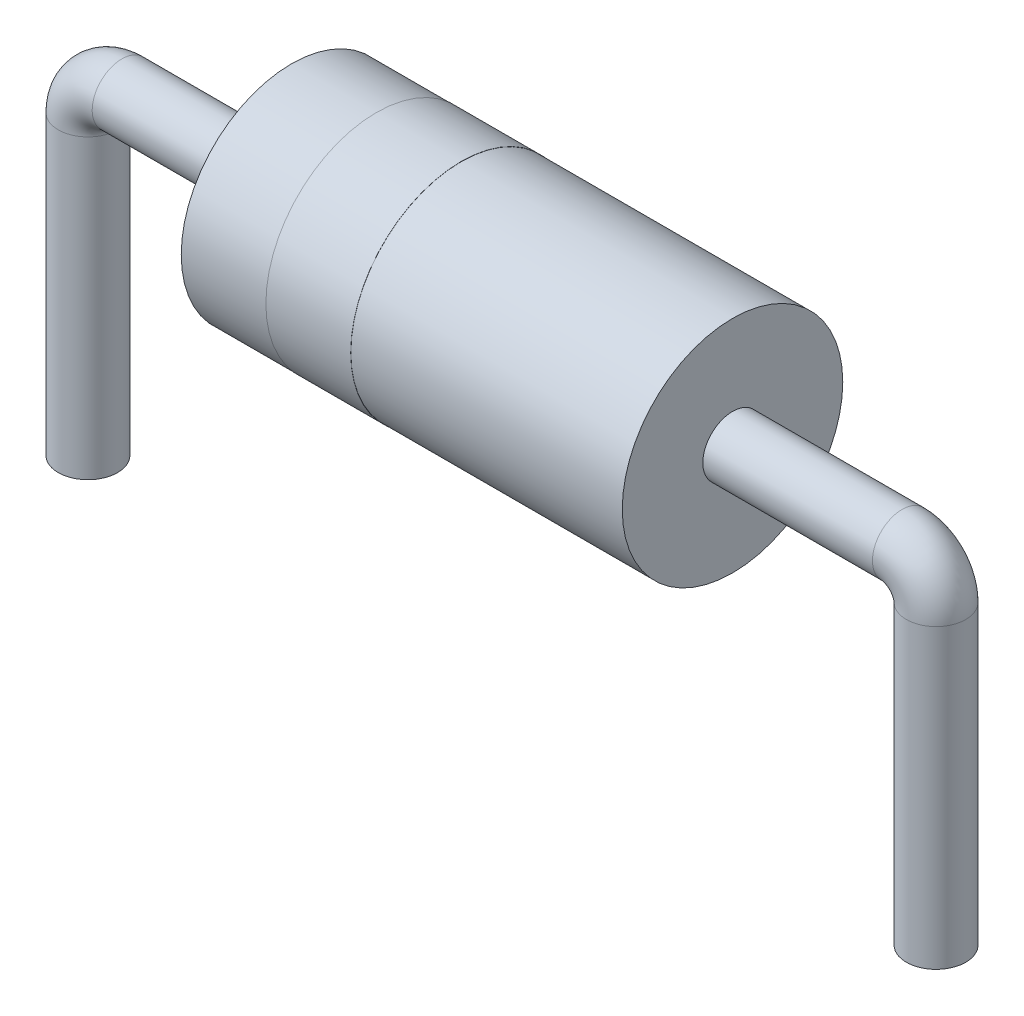
ISO-10303-21;
HEADER;
FILE_DESCRIPTION(('STEP AP214'),'2;1');
FILE_NAME('part.step','',(''),(''),'','','');
FILE_SCHEMA(('AUTOMOTIVE_DESIGN { 1 0 10303 214 1 1 1 1 }'));
ENDSEC;
DATA;
#1=APPLICATION_CONTEXT('core data for automotive mechanical design processes');
#2=APPLICATION_PROTOCOL_DEFINITION('international standard','automotive_design',2000,#1);
#3=PRODUCT_CONTEXT('',#1,'mechanical');
#4=PRODUCT('Part','Part','',(#3));
#5=PRODUCT_RELATED_PRODUCT_CATEGORY('part','',(#4));
#6=PRODUCT_DEFINITION_FORMATION('','',#4);
#7=PRODUCT_DEFINITION_CONTEXT('part definition',#1,'design');
#8=PRODUCT_DEFINITION('design','',#6,#7);
#9=PRODUCT_DEFINITION_SHAPE('','',#8);
#10=(LENGTH_UNIT() NAMED_UNIT(*) SI_UNIT(.MILLI.,.METRE.));
#11=(NAMED_UNIT(*) PLANE_ANGLE_UNIT() SI_UNIT($,.RADIAN.));
#12=(NAMED_UNIT(*) SI_UNIT($,.STERADIAN.) SOLID_ANGLE_UNIT());
#13=UNCERTAINTY_MEASURE_WITH_UNIT(LENGTH_MEASURE(1.E-05),#10,'distance_accuracy_value','');
#14=(GEOMETRIC_REPRESENTATION_CONTEXT(3) GLOBAL_UNCERTAINTY_ASSIGNED_CONTEXT((#13)) GLOBAL_UNIT_ASSIGNED_CONTEXT((#10,
#11,#12)) REPRESENTATION_CONTEXT('',''));
#15=CARTESIAN_POINT('',(0.,0.,0.));
#16=DIRECTION('',(0.,0.,1.));
#17=DIRECTION('',(1.,0.,0.));
#18=AXIS2_PLACEMENT_3D('',#15,#16,#17);
#19=CARTESIAN_POINT('',(0.,0.,0.));
#20=DIRECTION('',(1.,0.,0.));
#21=DIRECTION('',(0.,0.,-1.));
#22=AXIS2_PLACEMENT_3D('',#19,#20,#21);
#23=PLANE('',#22);
#24=CARTESIAN_POINT('',(0.,0.,0.));
#25=DIRECTION('',(1.,0.,0.));
#26=DIRECTION('',(0.,0.,-1.));
#27=AXIS2_PLACEMENT_3D('',#24,#25,#26);
#28=CIRCLE('',#27,1.3);
#29=CARTESIAN_POINT('',(0.,0.,-1.3));
#30=VERTEX_POINT('',#29);
#31=EDGE_CURVE('E74',#30,#30,#28,.T.);
#32=ORIENTED_EDGE('',*,*,#31,.F.);
#33=EDGE_LOOP('',(#32));
#34=FACE_BOUND('',#33,.T.);
#35=CARTESIAN_POINT('',(0.,0.,0.));
#36=DIRECTION('',(-1.,0.,0.));
#37=DIRECTION('',(0.,0.,1.));
#38=AXIS2_PLACEMENT_3D('',#35,#36,#37);
#39=CIRCLE('',#38,0.35);
#40=CARTESIAN_POINT('',(0.,0.,0.35));
#41=VERTEX_POINT('',#40);
#42=EDGE_CURVE('E10',#41,#41,#39,.T.);
#43=ORIENTED_EDGE('',*,*,#42,.F.);
#44=EDGE_LOOP('',(#43));
#45=FACE_BOUND('',#44,.T.);
#46=ADVANCED_FACE('F32',(#34,#45),#23,.F.);
#47=CARTESIAN_POINT('',(5.2,0.,0.));
#48=DIRECTION('',(-1.,0.,0.));
#49=DIRECTION('',(0.,0.,1.));
#50=AXIS2_PLACEMENT_3D('',#47,#48,#49);
#51=CYLINDRICAL_SURFACE('',#50,1.3);
#52=CARTESIAN_POINT('',(1.,0.,0.));
#53=DIRECTION('',(-1.,0.,0.));
#54=DIRECTION('',(0.,0.,1.));
#55=AXIS2_PLACEMENT_3D('',#52,#53,#54);
#56=CIRCLE('',#55,1.3);
#57=CARTESIAN_POINT('',(1.,0.,1.3));
#58=VERTEX_POINT('',#57);
#59=EDGE_CURVE('E36',#58,#58,#56,.T.);
#60=ORIENTED_EDGE('',*,*,#59,.T.);
#61=EDGE_LOOP('',(#60));
#62=FACE_BOUND('',#61,.T.);
#63=ORIENTED_EDGE('',*,*,#31,.T.);
#64=EDGE_LOOP('',(#63));
#65=FACE_BOUND('',#64,.T.);
#66=ADVANCED_FACE('F34',(#62,#65),#51,.T.);
#67=CARTESIAN_POINT('',(1.,0.,0.));
#68=DIRECTION('',(-1.,0.,0.));
#69=DIRECTION('',(0.,0.,1.));
#70=AXIS2_PLACEMENT_3D('',#67,#68,#69);
#71=PLANE('',#70);
#72=CARTESIAN_POINT('',(1.,0.,0.));
#73=DIRECTION('',(-1.,0.,0.));
#74=DIRECTION('',(0.,0.,1.));
#75=AXIS2_PLACEMENT_3D('',#72,#73,#74);
#76=CIRCLE('',#75,1.302);
#77=CARTESIAN_POINT('',(1.,0.,1.302));
#78=VERTEX_POINT('',#77);
#79=EDGE_CURVE('E66',#78,#78,#76,.T.);
#80=ORIENTED_EDGE('',*,*,#79,.T.);
#81=EDGE_LOOP('',(#80));
#82=FACE_BOUND('',#81,.T.);
#83=ORIENTED_EDGE('',*,*,#59,.F.);
#84=EDGE_LOOP('',(#83));
#85=FACE_BOUND('',#84,.T.);
#86=ADVANCED_FACE('F98',(#82,#85),#71,.T.);
#87=CARTESIAN_POINT('',(2.,0.,0.));
#88=DIRECTION('',(-1.,0.,0.));
#89=DIRECTION('',(0.,0.,1.));
#90=AXIS2_PLACEMENT_3D('',#87,#88,#89);
#91=PLANE('',#90);
#92=CARTESIAN_POINT('',(2.,0.,0.));
#93=DIRECTION('',(-1.,0.,0.));
#94=DIRECTION('',(0.,0.,1.));
#95=AXIS2_PLACEMENT_3D('',#92,#93,#94);
#96=CIRCLE('',#95,1.302);
#97=CARTESIAN_POINT('',(2.,0.,1.302));
#98=VERTEX_POINT('',#97);
#99=EDGE_CURVE('E65',#98,#98,#96,.T.);
#100=ORIENTED_EDGE('',*,*,#99,.F.);
#101=EDGE_LOOP('',(#100));
#102=FACE_BOUND('',#101,.T.);
#103=CARTESIAN_POINT('',(2.,0.,0.));
#104=DIRECTION('',(-1.,0.,0.));
#105=DIRECTION('',(0.,0.,1.));
#106=AXIS2_PLACEMENT_3D('',#103,#104,#105);
#107=CIRCLE('',#106,1.3);
#108=CARTESIAN_POINT('',(2.,0.,1.3));
#109=VERTEX_POINT('',#108);
#110=EDGE_CURVE('E45',#109,#109,#107,.T.);
#111=ORIENTED_EDGE('',*,*,#110,.T.);
#112=EDGE_LOOP('',(#111));
#113=FACE_BOUND('',#112,.T.);
#114=ADVANCED_FACE('F79',(#102,#113),#91,.F.);
#115=CARTESIAN_POINT('',(1.,0.,0.));
#116=DIRECTION('',(1.,0.,0.));
#117=DIRECTION('',(0.,0.,-1.));
#118=AXIS2_PLACEMENT_3D('',#115,#116,#117);
#119=CYLINDRICAL_SURFACE('',#118,1.302);
#120=ORIENTED_EDGE('',*,*,#79,.F.);
#121=EDGE_LOOP('',(#120));
#122=FACE_BOUND('',#121,.T.);
#123=ORIENTED_EDGE('',*,*,#99,.T.);
#124=EDGE_LOOP('',(#123));
#125=FACE_BOUND('',#124,.T.);
#126=ADVANCED_FACE('F93',(#122,#125),#119,.T.);
#127=CARTESIAN_POINT('',(5.2,0.,0.));
#128=DIRECTION('',(1.,0.,0.));
#129=DIRECTION('',(0.,0.,-1.));
#130=AXIS2_PLACEMENT_3D('',#127,#128,#129);
#131=PLANE('',#130);
#132=CARTESIAN_POINT('',(5.2,0.,0.));
#133=DIRECTION('',(1.,0.,0.));
#134=DIRECTION('',(0.,0.,-1.));
#135=AXIS2_PLACEMENT_3D('',#132,#133,#134);
#136=CIRCLE('',#135,0.35);
#137=CARTESIAN_POINT('',(5.2,0.,-0.35));
#138=VERTEX_POINT('',#137);
#139=EDGE_CURVE('E40',#138,#138,#136,.T.);
#140=ORIENTED_EDGE('',*,*,#139,.F.);
#141=EDGE_LOOP('',(#140));
#142=FACE_BOUND('',#141,.T.);
#143=CARTESIAN_POINT('',(5.2,0.,0.));
#144=DIRECTION('',(1.,0.,0.));
#145=DIRECTION('',(0.,0.,-1.));
#146=AXIS2_PLACEMENT_3D('',#143,#144,#145);
#147=CIRCLE('',#146,1.3);
#148=CARTESIAN_POINT('',(5.2,0.,-1.3));
#149=VERTEX_POINT('',#148);
#150=EDGE_CURVE('E71',#149,#149,#147,.T.);
#151=ORIENTED_EDGE('',*,*,#150,.T.);
#152=EDGE_LOOP('',(#151));
#153=FACE_BOUND('',#152,.T.);
#154=ADVANCED_FACE('F84',(#142,#153),#131,.T.);
#155=ORIENTED_EDGE('',*,*,#150,.F.);
#156=EDGE_LOOP('',(#155));
#157=FACE_BOUND('',#156,.T.);
#158=ORIENTED_EDGE('',*,*,#110,.F.);
#159=EDGE_LOOP('',(#158));
#160=FACE_BOUND('',#159,.T.);
#161=ADVANCED_FACE('F81',(#157,#160),#51,.T.);
#162=CARTESIAN_POINT('',(7.6,-0.4,0.));
#163=DIRECTION('',(0.,-1.,0.));
#164=DIRECTION('',(0.,0.,-1.));
#165=AXIS2_PLACEMENT_3D('',#162,#163,#164);
#166=CYLINDRICAL_SURFACE('',#165,0.35);
#167=CARTESIAN_POINT('',(7.6,-0.4,0.));
#168=DIRECTION('',(0.,-1.,0.));
#169=DIRECTION('',(0.,0.,-1.));
#170=AXIS2_PLACEMENT_3D('',#167,#168,#169);
#171=CIRCLE('',#170,0.35);
#172=CARTESIAN_POINT('',(7.95,-0.4,0.));
#173=VERTEX_POINT('',#172);
#174=EDGE_CURVE('E58',#173,#173,#171,.T.);
#175=ORIENTED_EDGE('',*,*,#174,.T.);
#176=EDGE_LOOP('',(#175));
#177=FACE_BOUND('',#176,.T.);
#178=CARTESIAN_POINT('',(7.6,-3.9,0.));
#179=DIRECTION('',(0.,-1.,0.));
#180=DIRECTION('',(0.,0.,-1.));
#181=AXIS2_PLACEMENT_3D('',#178,#179,#180);
#182=CIRCLE('',#181,0.35);
#183=CARTESIAN_POINT('',(7.6,-3.9,-0.35));
#184=VERTEX_POINT('',#183);
#185=EDGE_CURVE('E62',#184,#184,#182,.T.);
#186=ORIENTED_EDGE('',*,*,#185,.F.);
#187=EDGE_LOOP('',(#186));
#188=FACE_BOUND('',#187,.T.);
#189=ADVANCED_FACE('F83',(#177,#188),#166,.T.);
#190=CARTESIAN_POINT('',(7.2,-0.4,0.));
#191=DIRECTION('',(0.,0.,-1.));
#192=DIRECTION('',(-1.,0.,0.));
#193=AXIS2_PLACEMENT_3D('',#190,#191,#192);
#194=TOROIDAL_SURFACE('',#193,0.4,0.35);
#195=CARTESIAN_POINT('',(7.2,0.,0.));
#196=DIRECTION('',(1.,0.,0.));
#197=DIRECTION('',(0.,0.,-1.));
#198=AXIS2_PLACEMENT_3D('',#195,#196,#197);
#199=CIRCLE('',#198,0.35);
#200=CARTESIAN_POINT('',(7.2,0.35,0.));
#201=VERTEX_POINT('',#200);
#202=EDGE_CURVE('E56',#201,#201,#199,.T.);
#203=CARTESIAN_POINT('',(7.2,-0.4,0.));
#204=DIRECTION('',(0.,0.,-1.));
#205=DIRECTION('',(-1.,0.,0.));
#206=AXIS2_PLACEMENT_3D('',#203,#204,#205);
#207=CIRCLE('',#206,0.75);
#208=EDGE_CURVE('',#201,#173,#207,.T.);
#209=ORIENTED_EDGE('',*,*,#202,.T.);
#210=ORIENTED_EDGE('',*,*,#174,.F.);
#211=ORIENTED_EDGE('',*,*,#208,.T.);
#212=ORIENTED_EDGE('',*,*,#208,.F.);
#213=EDGE_LOOP('',(#209,#211,#210,#212));
#214=FACE_BOUND('',#213,.T.);
#215=ADVANCED_FACE('F90',(#214),#194,.T.);
#216=CARTESIAN_POINT('',(7.2,0.,0.));
#217=DIRECTION('',(-1.,0.,0.));
#218=DIRECTION('',(0.,0.,1.));
#219=AXIS2_PLACEMENT_3D('',#216,#217,#218);
#220=CYLINDRICAL_SURFACE('',#219,0.35);
#221=ORIENTED_EDGE('',*,*,#202,.F.);
#222=EDGE_LOOP('',(#221));
#223=FACE_BOUND('',#222,.T.);
#224=ORIENTED_EDGE('',*,*,#139,.T.);
#225=EDGE_LOOP('',(#224));
#226=FACE_BOUND('',#225,.T.);
#227=ADVANCED_FACE('F118',(#223,#226),#220,.T.);
#228=CARTESIAN_POINT('',(7.6,-3.9,0.));
#229=DIRECTION('',(0.,-1.,0.));
#230=DIRECTION('',(0.,0.,-1.));
#231=AXIS2_PLACEMENT_3D('',#228,#229,#230);
#232=PLANE('',#231);
#233=ORIENTED_EDGE('',*,*,#185,.T.);
#234=EDGE_LOOP('',(#233));
#235=FACE_BOUND('',#234,.T.);
#236=ADVANCED_FACE('F122',(#235),#232,.T.);
#237=CARTESIAN_POINT('',(-2.4,-0.4,0.));
#238=DIRECTION('',(0.,-1.,0.));
#239=DIRECTION('',(1.,0.,0.));
#240=AXIS2_PLACEMENT_3D('',#237,#238,#239);
#241=CYLINDRICAL_SURFACE('',#240,0.35);
#242=CARTESIAN_POINT('',(-2.4,-0.4,0.));
#243=DIRECTION('',(0.,-1.,0.));
#244=DIRECTION('',(0.,0.,1.));
#245=AXIS2_PLACEMENT_3D('',#242,#243,#244);
#246=CIRCLE('',#245,0.35);
#247=CARTESIAN_POINT('',(-2.75,-0.4,0.));
#248=VERTEX_POINT('',#247);
#249=EDGE_CURVE('E50',#248,#248,#246,.T.);
#250=ORIENTED_EDGE('',*,*,#249,.T.);
#251=EDGE_LOOP('',(#250));
#252=FACE_BOUND('',#251,.T.);
#253=CARTESIAN_POINT('',(-2.4,-3.9,0.));
#254=DIRECTION('',(0.,-1.,0.));
#255=DIRECTION('',(0.,0.,1.));
#256=AXIS2_PLACEMENT_3D('',#253,#254,#255);
#257=CIRCLE('',#256,0.35);
#258=CARTESIAN_POINT('',(-2.4,-3.9,0.35));
#259=VERTEX_POINT('',#258);
#260=EDGE_CURVE('E53',#259,#259,#257,.T.);
#261=ORIENTED_EDGE('',*,*,#260,.F.);
#262=EDGE_LOOP('',(#261));
#263=FACE_BOUND('',#262,.T.);
#264=ADVANCED_FACE('F126',(#252,#263),#241,.T.);
#265=CARTESIAN_POINT('',(-2.,-0.4,0.));
#266=DIRECTION('',(0.,0.,1.));
#267=DIRECTION('',(1.,0.,0.));
#268=AXIS2_PLACEMENT_3D('',#265,#266,#267);
#269=TOROIDAL_SURFACE('',#268,0.4,0.35);
#270=CARTESIAN_POINT('',(-2.,0.,0.));
#271=DIRECTION('',(-1.,0.,0.));
#272=DIRECTION('',(0.,0.,1.));
#273=AXIS2_PLACEMENT_3D('',#270,#271,#272);
#274=CIRCLE('',#273,0.35);
#275=CARTESIAN_POINT('',(-2.,0.35,0.));
#276=VERTEX_POINT('',#275);
#277=EDGE_CURVE('E49',#276,#276,#274,.T.);
#278=CARTESIAN_POINT('',(-2.,-0.4,0.));
#279=DIRECTION('',(0.,0.,1.));
#280=DIRECTION('',(1.,0.,0.));
#281=AXIS2_PLACEMENT_3D('',#278,#279,#280);
#282=CIRCLE('',#281,0.75);
#283=EDGE_CURVE('',#276,#248,#282,.T.);
#284=ORIENTED_EDGE('',*,*,#277,.T.);
#285=ORIENTED_EDGE('',*,*,#249,.F.);
#286=ORIENTED_EDGE('',*,*,#283,.T.);
#287=ORIENTED_EDGE('',*,*,#283,.F.);
#288=EDGE_LOOP('',(#284,#286,#285,#287));
#289=FACE_BOUND('',#288,.T.);
#290=ADVANCED_FACE('F130',(#289),#269,.T.);
#291=CARTESIAN_POINT('',(-2.,0.,0.));
#292=DIRECTION('',(1.,0.,0.));
#293=DIRECTION('',(0.,1.,0.));
#294=AXIS2_PLACEMENT_3D('',#291,#292,#293);
#295=CYLINDRICAL_SURFACE('',#294,0.35);
#296=ORIENTED_EDGE('',*,*,#277,.F.);
#297=EDGE_LOOP('',(#296));
#298=FACE_BOUND('',#297,.T.);
#299=ORIENTED_EDGE('',*,*,#42,.T.);
#300=EDGE_LOOP('',(#299));
#301=FACE_BOUND('',#300,.T.);
#302=ADVANCED_FACE('F134',(#298,#301),#295,.T.);
#303=CARTESIAN_POINT('',(-2.4,-3.9,0.));
#304=DIRECTION('',(0.,-1.,0.));
#305=DIRECTION('',(0.,0.,1.));
#306=AXIS2_PLACEMENT_3D('',#303,#304,#305);
#307=PLANE('',#306);
#308=ORIENTED_EDGE('',*,*,#260,.T.);
#309=EDGE_LOOP('',(#308));
#310=FACE_BOUND('',#309,.T.);
#311=ADVANCED_FACE('F138',(#310),#307,.T.);
#312=CLOSED_SHELL('',(#46,#66,#86,#114,#126,#154,#161,#189,#215,#227,#236,#264,#290,#302,#311));
#313=MANIFOLD_SOLID_BREP('B2',#312);
#314=ADVANCED_BREP_SHAPE_REPRESENTATION('',(#18,#313),#14);
#315=SHAPE_DEFINITION_REPRESENTATION(#9,#314);
ENDSEC;
END-ISO-10303-21;
